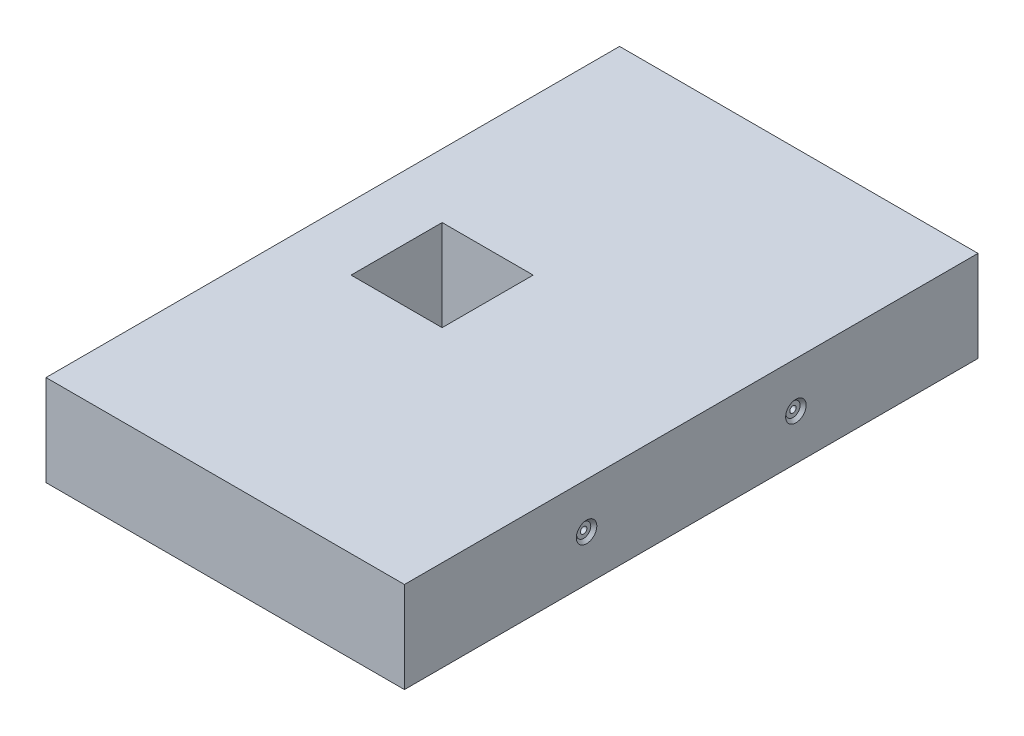
ISO-10303-21;
HEADER;
FILE_DESCRIPTION(('STEP AP214'),'2;1');
FILE_NAME('part.step','',(''),(''),'','','');
FILE_SCHEMA(('AUTOMOTIVE_DESIGN { 1 0 10303 214 1 1 1 1 }'));
ENDSEC;
DATA;
#1=APPLICATION_CONTEXT('core data for automotive mechanical design processes');
#2=APPLICATION_PROTOCOL_DEFINITION('international standard','automotive_design',2000,#1);
#3=PRODUCT_CONTEXT('',#1,'mechanical');
#4=PRODUCT('Part','Part','',(#3));
#5=PRODUCT_RELATED_PRODUCT_CATEGORY('part','',(#4));
#6=PRODUCT_DEFINITION_FORMATION('','',#4);
#7=PRODUCT_DEFINITION_CONTEXT('part definition',#1,'design');
#8=PRODUCT_DEFINITION('design','',#6,#7);
#9=PRODUCT_DEFINITION_SHAPE('','',#8);
#10=(LENGTH_UNIT() NAMED_UNIT(*) SI_UNIT(.MILLI.,.METRE.));
#11=(NAMED_UNIT(*) PLANE_ANGLE_UNIT() SI_UNIT($,.RADIAN.));
#12=(NAMED_UNIT(*) SI_UNIT($,.STERADIAN.) SOLID_ANGLE_UNIT());
#13=UNCERTAINTY_MEASURE_WITH_UNIT(LENGTH_MEASURE(1.E-05),#10,'distance_accuracy_value','');
#14=(GEOMETRIC_REPRESENTATION_CONTEXT(3) GLOBAL_UNCERTAINTY_ASSIGNED_CONTEXT((#13)) GLOBAL_UNIT_ASSIGNED_CONTEXT((#10,
#11,#12)) REPRESENTATION_CONTEXT('',''));
#15=CARTESIAN_POINT('',(0.,0.,0.));
#16=DIRECTION('',(0.,0.,1.));
#17=DIRECTION('',(1.,0.,0.));
#18=AXIS2_PLACEMENT_3D('',#15,#16,#17);
#19=CARTESIAN_POINT('',(0.,25.4,0.));
#20=DIRECTION('',(0.,1.,0.));
#21=DIRECTION('',(0.,0.,1.));
#22=AXIS2_PLACEMENT_3D('',#19,#20,#21);
#23=PLANE('',#22);
#24=DIRECTION('',(0.,0.,-1.));
#25=VECTOR('',#24,1.);
#26=CARTESIAN_POINT('',(50.,25.4,-80.));
#27=LINE('',#26,#25);
#28=CARTESIAN_POINT('',(50.,25.4,80.));
#29=VERTEX_POINT('',#28);
#30=CARTESIAN_POINT('',(50.,25.4,-80.));
#31=VERTEX_POINT('',#30);
#32=EDGE_CURVE('E162',#29,#31,#27,.T.);
#33=ORIENTED_EDGE('',*,*,#32,.T.);
#34=DIRECTION('',(-1.,0.,0.));
#35=VECTOR('',#34,1.);
#36=CARTESIAN_POINT('',(-50.,25.4,-80.));
#37=LINE('',#36,#35);
#38=CARTESIAN_POINT('',(-50.,25.4,-80.));
#39=VERTEX_POINT('',#38);
#40=EDGE_CURVE('E165',#31,#39,#37,.T.);
#41=ORIENTED_EDGE('',*,*,#40,.T.);
#42=DIRECTION('',(0.,0.,1.));
#43=VECTOR('',#42,1.);
#44=CARTESIAN_POINT('',(-50.,25.4,-80.));
#45=LINE('',#44,#43);
#46=CARTESIAN_POINT('',(-50.,25.4,80.));
#47=VERTEX_POINT('',#46);
#48=EDGE_CURVE('E168',#39,#47,#45,.T.);
#49=ORIENTED_EDGE('',*,*,#48,.T.);
#50=DIRECTION('',(1.,0.,0.));
#51=VECTOR('',#50,1.);
#52=CARTESIAN_POINT('',(-50.,25.4,80.));
#53=LINE('',#52,#51);
#54=EDGE_CURVE('E170',#47,#29,#53,.T.);
#55=ORIENTED_EDGE('',*,*,#54,.T.);
#56=EDGE_LOOP('',(#33,#41,#49,#55));
#57=FACE_BOUND('',#56,.T.);
#58=DIRECTION('',(-1.,0.,0.));
#59=VECTOR('',#58,1.);
#60=CARTESIAN_POINT('',(-32.19,25.4,-12.7));
#61=LINE('',#60,#59);
#62=CARTESIAN_POINT('',(-6.79,25.4,-12.7));
#63=VERTEX_POINT('',#62);
#64=CARTESIAN_POINT('',(-32.19,25.4,-12.7));
#65=VERTEX_POINT('',#64);
#66=EDGE_CURVE('E138',#63,#65,#61,.T.);
#67=ORIENTED_EDGE('',*,*,#66,.F.);
#68=DIRECTION('',(0.,0.,-1.));
#69=VECTOR('',#68,1.);
#70=CARTESIAN_POINT('',(-6.79,25.4,-12.7));
#71=LINE('',#70,#69);
#72=CARTESIAN_POINT('',(-6.79,25.4,12.7));
#73=VERTEX_POINT('',#72);
#74=EDGE_CURVE('E136',#73,#63,#71,.T.);
#75=ORIENTED_EDGE('',*,*,#74,.F.);
#76=DIRECTION('',(1.,0.,0.));
#77=VECTOR('',#76,1.);
#78=CARTESIAN_POINT('',(-32.19,25.4,12.7));
#79=LINE('',#78,#77);
#80=CARTESIAN_POINT('',(-32.19,25.4,12.7));
#81=VERTEX_POINT('',#80);
#82=EDGE_CURVE('E143',#81,#73,#79,.T.);
#83=ORIENTED_EDGE('',*,*,#82,.F.);
#84=DIRECTION('',(0.,0.,1.));
#85=VECTOR('',#84,1.);
#86=CARTESIAN_POINT('',(-32.19,25.4,-12.7));
#87=LINE('',#86,#85);
#88=EDGE_CURVE('E141',#65,#81,#87,.T.);
#89=ORIENTED_EDGE('',*,*,#88,.F.);
#90=EDGE_LOOP('',(#67,#75,#83,#89));
#91=FACE_BOUND('',#90,.T.);
#92=ADVANCED_FACE('F33',(#57,#91),#23,.T.);
#93=CARTESIAN_POINT('',(0.,0.,0.));
#94=DIRECTION('',(0.,1.,0.));
#95=DIRECTION('',(0.,0.,1.));
#96=AXIS2_PLACEMENT_3D('',#93,#94,#95);
#97=PLANE('',#96);
#98=DIRECTION('',(0.,0.,-1.));
#99=VECTOR('',#98,1.);
#100=CARTESIAN_POINT('',(50.,0.,-80.));
#101=LINE('',#100,#99);
#102=CARTESIAN_POINT('',(50.,0.,80.));
#103=VERTEX_POINT('',#102);
#104=CARTESIAN_POINT('',(50.,0.,-80.));
#105=VERTEX_POINT('',#104);
#106=EDGE_CURVE('E161',#103,#105,#101,.T.);
#107=ORIENTED_EDGE('',*,*,#106,.F.);
#108=DIRECTION('',(1.,0.,0.));
#109=VECTOR('',#108,1.);
#110=CARTESIAN_POINT('',(-50.,0.,80.));
#111=LINE('',#110,#109);
#112=CARTESIAN_POINT('',(-50.,0.,80.));
#113=VERTEX_POINT('',#112);
#114=EDGE_CURVE('E166',#113,#103,#111,.T.);
#115=ORIENTED_EDGE('',*,*,#114,.F.);
#116=DIRECTION('',(0.,0.,1.));
#117=VECTOR('',#116,1.);
#118=CARTESIAN_POINT('',(-50.,0.,-80.));
#119=LINE('',#118,#117);
#120=CARTESIAN_POINT('',(-50.,0.,-80.));
#121=VERTEX_POINT('',#120);
#122=EDGE_CURVE('E177',#121,#113,#119,.T.);
#123=ORIENTED_EDGE('',*,*,#122,.F.);
#124=DIRECTION('',(-1.,0.,0.));
#125=VECTOR('',#124,1.);
#126=CARTESIAN_POINT('',(-50.,0.,-80.));
#127=LINE('',#126,#125);
#128=EDGE_CURVE('E175',#105,#121,#127,.T.);
#129=ORIENTED_EDGE('',*,*,#128,.F.);
#130=EDGE_LOOP('',(#107,#115,#123,#129));
#131=FACE_BOUND('',#130,.T.);
#132=DIRECTION('',(0.,0.,-1.));
#133=VECTOR('',#132,1.);
#134=CARTESIAN_POINT('',(-6.79,0.,-12.7));
#135=LINE('',#134,#133);
#136=CARTESIAN_POINT('',(-6.79,0.,12.7));
#137=VERTEX_POINT('',#136);
#138=CARTESIAN_POINT('',(-6.79,0.,-12.7));
#139=VERTEX_POINT('',#138);
#140=EDGE_CURVE('E56',#137,#139,#135,.T.);
#141=ORIENTED_EDGE('',*,*,#140,.T.);
#142=DIRECTION('',(-1.,0.,0.));
#143=VECTOR('',#142,1.);
#144=CARTESIAN_POINT('',(-32.19,0.,-12.7));
#145=LINE('',#144,#143);
#146=CARTESIAN_POINT('',(-32.19,0.,-12.7));
#147=VERTEX_POINT('',#146);
#148=EDGE_CURVE('E147',#139,#147,#145,.T.);
#149=ORIENTED_EDGE('',*,*,#148,.T.);
#150=DIRECTION('',(0.,0.,1.));
#151=VECTOR('',#150,1.);
#152=CARTESIAN_POINT('',(-32.19,0.,-12.7));
#153=LINE('',#152,#151);
#154=CARTESIAN_POINT('',(-32.19,0.,12.7));
#155=VERTEX_POINT('',#154);
#156=EDGE_CURVE('E150',#147,#155,#153,.T.);
#157=ORIENTED_EDGE('',*,*,#156,.T.);
#158=DIRECTION('',(1.,0.,0.));
#159=VECTOR('',#158,1.);
#160=CARTESIAN_POINT('',(-32.19,0.,12.7));
#161=LINE('',#160,#159);
#162=EDGE_CURVE('E139',#155,#137,#161,.T.);
#163=ORIENTED_EDGE('',*,*,#162,.T.);
#164=EDGE_LOOP('',(#141,#149,#157,#163));
#165=FACE_BOUND('',#164,.T.);
#166=ADVANCED_FACE('F195',(#131,#165),#97,.F.);
#167=CARTESIAN_POINT('',(50.,25.4,-80.));
#168=DIRECTION('',(-1.,0.,0.));
#169=DIRECTION('',(0.,0.,1.));
#170=AXIS2_PLACEMENT_3D('',#167,#168,#169);
#171=PLANE('',#170);
#172=CARTESIAN_POINT('',(50.,12.7,29.2));
#173=DIRECTION('',(1.,0.,0.));
#174=DIRECTION('',(0.,0.,-1.));
#175=AXIS2_PLACEMENT_3D('',#172,#173,#174);
#176=CIRCLE('',#175,2.8575);
#177=CARTESIAN_POINT('',(50.,12.7,26.3425));
#178=VERTEX_POINT('',#177);
#179=EDGE_CURVE('E283',#178,#178,#176,.T.);
#180=ORIENTED_EDGE('',*,*,#179,.F.);
#181=EDGE_LOOP('',(#180));
#182=FACE_BOUND('',#181,.T.);
#183=CARTESIAN_POINT('',(50.,12.7,-29.2));
#184=DIRECTION('',(1.,0.,0.));
#185=DIRECTION('',(0.,0.,-1.));
#186=AXIS2_PLACEMENT_3D('',#183,#184,#185);
#187=CIRCLE('',#186,2.8575);
#188=CARTESIAN_POINT('',(50.,12.7,-32.0575));
#189=VERTEX_POINT('',#188);
#190=EDGE_CURVE('E114',#189,#189,#187,.T.);
#191=ORIENTED_EDGE('',*,*,#190,.F.);
#192=EDGE_LOOP('',(#191));
#193=FACE_BOUND('',#192,.T.);
#194=ORIENTED_EDGE('',*,*,#106,.T.);
#195=DIRECTION('',(0.,-1.,0.));
#196=VECTOR('',#195,1.);
#197=CARTESIAN_POINT('',(50.,25.4,-80.));
#198=LINE('',#197,#196);
#199=EDGE_CURVE('E11',#31,#105,#198,.T.);
#200=ORIENTED_EDGE('',*,*,#199,.F.);
#201=ORIENTED_EDGE('',*,*,#32,.F.);
#202=DIRECTION('',(0.,-1.,0.));
#203=VECTOR('',#202,1.);
#204=CARTESIAN_POINT('',(50.,25.4,80.));
#205=LINE('',#204,#203);
#206=EDGE_CURVE('E172',#29,#103,#205,.T.);
#207=ORIENTED_EDGE('',*,*,#206,.T.);
#208=EDGE_LOOP('',(#194,#200,#201,#207));
#209=FACE_BOUND('',#208,.T.);
#210=ADVANCED_FACE('F35',(#182,#193,#209),#171,.F.);
#211=CARTESIAN_POINT('',(-50.,25.4,-80.));
#212=DIRECTION('',(0.,0.,1.));
#213=DIRECTION('',(1.,0.,0.));
#214=AXIS2_PLACEMENT_3D('',#211,#212,#213);
#215=PLANE('',#214);
#216=ORIENTED_EDGE('',*,*,#128,.T.);
#217=DIRECTION('',(0.,-1.,0.));
#218=VECTOR('',#217,1.);
#219=CARTESIAN_POINT('',(-50.,25.4,-80.));
#220=LINE('',#219,#218);
#221=EDGE_CURVE('E41',#39,#121,#220,.T.);
#222=ORIENTED_EDGE('',*,*,#221,.F.);
#223=ORIENTED_EDGE('',*,*,#40,.F.);
#224=ORIENTED_EDGE('',*,*,#199,.T.);
#225=EDGE_LOOP('',(#216,#222,#223,#224));
#226=FACE_BOUND('',#225,.T.);
#227=ADVANCED_FACE('F206',(#226),#215,.F.);
#228=CARTESIAN_POINT('',(-50.,25.4,-80.));
#229=DIRECTION('',(1.,0.,0.));
#230=DIRECTION('',(0.,0.,-1.));
#231=AXIS2_PLACEMENT_3D('',#228,#229,#230);
#232=PLANE('',#231);
#233=ORIENTED_EDGE('',*,*,#122,.T.);
#234=DIRECTION('',(0.,-1.,0.));
#235=VECTOR('',#234,1.);
#236=CARTESIAN_POINT('',(-50.,25.4,80.));
#237=LINE('',#236,#235);
#238=EDGE_CURVE('E182',#47,#113,#237,.T.);
#239=ORIENTED_EDGE('',*,*,#238,.F.);
#240=ORIENTED_EDGE('',*,*,#48,.F.);
#241=ORIENTED_EDGE('',*,*,#221,.T.);
#242=EDGE_LOOP('',(#233,#239,#240,#241));
#243=FACE_BOUND('',#242,.T.);
#244=ADVANCED_FACE('F189',(#243),#232,.F.);
#245=CARTESIAN_POINT('',(-50.,25.4,80.));
#246=DIRECTION('',(0.,0.,-1.));
#247=DIRECTION('',(-1.,0.,0.));
#248=AXIS2_PLACEMENT_3D('',#245,#246,#247);
#249=PLANE('',#248);
#250=ORIENTED_EDGE('',*,*,#114,.T.);
#251=ORIENTED_EDGE('',*,*,#206,.F.);
#252=ORIENTED_EDGE('',*,*,#54,.F.);
#253=ORIENTED_EDGE('',*,*,#238,.T.);
#254=EDGE_LOOP('',(#250,#251,#252,#253));
#255=FACE_BOUND('',#254,.T.);
#256=ADVANCED_FACE('F199',(#255),#249,.F.);
#257=CARTESIAN_POINT('',(-6.79,25.4,-12.7));
#258=DIRECTION('',(-1.,0.,0.));
#259=DIRECTION('',(0.,0.,1.));
#260=AXIS2_PLACEMENT_3D('',#257,#258,#259);
#261=PLANE('',#260);
#262=ORIENTED_EDGE('',*,*,#140,.F.);
#263=DIRECTION('',(0.,-1.,0.));
#264=VECTOR('',#263,1.);
#265=CARTESIAN_POINT('',(-6.79,25.4,12.7));
#266=LINE('',#265,#264);
#267=EDGE_CURVE('E145',#73,#137,#266,.T.);
#268=ORIENTED_EDGE('',*,*,#267,.F.);
#269=ORIENTED_EDGE('',*,*,#74,.T.);
#270=DIRECTION('',(0.,-1.,0.));
#271=VECTOR('',#270,1.);
#272=CARTESIAN_POINT('',(-6.79,25.4,-12.7));
#273=LINE('',#272,#271);
#274=EDGE_CURVE('E159',#63,#139,#273,.T.);
#275=ORIENTED_EDGE('',*,*,#274,.T.);
#276=EDGE_LOOP('',(#262,#268,#269,#275));
#277=FACE_BOUND('',#276,.T.);
#278=ADVANCED_FACE('F221',(#277),#261,.T.);
#279=CARTESIAN_POINT('',(-32.19,25.4,-12.7));
#280=DIRECTION('',(0.,0.,1.));
#281=DIRECTION('',(1.,0.,0.));
#282=AXIS2_PLACEMENT_3D('',#279,#280,#281);
#283=PLANE('',#282);
#284=ORIENTED_EDGE('',*,*,#148,.F.);
#285=ORIENTED_EDGE('',*,*,#274,.F.);
#286=ORIENTED_EDGE('',*,*,#66,.T.);
#287=DIRECTION('',(0.,-1.,0.));
#288=VECTOR('',#287,1.);
#289=CARTESIAN_POINT('',(-32.19,25.4,-12.7));
#290=LINE('',#289,#288);
#291=EDGE_CURVE('E157',#65,#147,#290,.T.);
#292=ORIENTED_EDGE('',*,*,#291,.T.);
#293=EDGE_LOOP('',(#284,#285,#286,#292));
#294=FACE_BOUND('',#293,.T.);
#295=ADVANCED_FACE('F228',(#294),#283,.T.);
#296=CARTESIAN_POINT('',(-32.19,25.4,-12.7));
#297=DIRECTION('',(1.,0.,0.));
#298=DIRECTION('',(0.,0.,-1.));
#299=AXIS2_PLACEMENT_3D('',#296,#297,#298);
#300=PLANE('',#299);
#301=ORIENTED_EDGE('',*,*,#156,.F.);
#302=ORIENTED_EDGE('',*,*,#291,.F.);
#303=ORIENTED_EDGE('',*,*,#88,.T.);
#304=DIRECTION('',(0.,-1.,0.));
#305=VECTOR('',#304,1.);
#306=CARTESIAN_POINT('',(-32.19,25.4,12.7));
#307=LINE('',#306,#305);
#308=EDGE_CURVE('E48',#81,#155,#307,.T.);
#309=ORIENTED_EDGE('',*,*,#308,.T.);
#310=EDGE_LOOP('',(#301,#302,#303,#309));
#311=FACE_BOUND('',#310,.T.);
#312=ADVANCED_FACE('F232',(#311),#300,.T.);
#313=CARTESIAN_POINT('',(-32.19,25.4,12.7));
#314=DIRECTION('',(0.,0.,-1.));
#315=DIRECTION('',(-1.,0.,0.));
#316=AXIS2_PLACEMENT_3D('',#313,#314,#315);
#317=PLANE('',#316);
#318=ORIENTED_EDGE('',*,*,#162,.F.);
#319=ORIENTED_EDGE('',*,*,#308,.F.);
#320=ORIENTED_EDGE('',*,*,#82,.T.);
#321=ORIENTED_EDGE('',*,*,#267,.T.);
#322=EDGE_LOOP('',(#318,#319,#320,#321));
#323=FACE_BOUND('',#322,.T.);
#324=ADVANCED_FACE('F237',(#323),#317,.T.);
#325=CARTESIAN_POINT('',(20.,12.7,-29.2));
#326=DIRECTION('',(1.,0.,0.));
#327=DIRECTION('',(0.,0.,-1.));
#328=AXIS2_PLACEMENT_3D('',#325,#326,#327);
#329=CONICAL_SURFACE('',#328,0.888999999999992,1.02974425867665);
#330=CARTESIAN_POINT('',(19.4658349096845,12.7,-29.2));
#331=VERTEX_POINT('',#330);
#332=VERTEX_LOOP('',#331);
#333=FACE_BOUND('',#332,.T.);
#334=CARTESIAN_POINT('',(20.,12.7,-29.2));
#335=DIRECTION('',(1.,0.,0.));
#336=DIRECTION('',(0.,0.,-1.));
#337=AXIS2_PLACEMENT_3D('',#334,#335,#336);
#338=CIRCLE('',#337,0.888999999999992);
#339=CARTESIAN_POINT('',(20.,12.7,-30.089));
#340=VERTEX_POINT('',#339);
#341=EDGE_CURVE('E133',#340,#340,#338,.T.);
#342=ORIENTED_EDGE('',*,*,#341,.T.);
#343=EDGE_LOOP('',(#342));
#344=FACE_BOUND('',#343,.T.);
#345=ADVANCED_FACE('F243',(#333,#344),#329,.F.);
#346=CARTESIAN_POINT('',(50.,12.7,-29.2));
#347=DIRECTION('',(1.,0.,0.));
#348=DIRECTION('',(0.,0.,-1.));
#349=AXIS2_PLACEMENT_3D('',#346,#347,#348);
#350=CYLINDRICAL_SURFACE('',#349,0.888999999999994);
#351=ORIENTED_EDGE('',*,*,#341,.F.);
#352=EDGE_LOOP('',(#351));
#353=FACE_BOUND('',#352,.T.);
#354=CARTESIAN_POINT('',(49.1872,12.7,-29.2));
#355=DIRECTION('',(1.,0.,0.));
#356=DIRECTION('',(0.,0.,-1.));
#357=AXIS2_PLACEMENT_3D('',#354,#355,#356);
#358=CIRCLE('',#357,0.888999999999996);
#359=CARTESIAN_POINT('',(49.1872,12.7,-30.089));
#360=VERTEX_POINT('',#359);
#361=EDGE_CURVE('E130',#360,#360,#358,.T.);
#362=ORIENTED_EDGE('',*,*,#361,.T.);
#363=EDGE_LOOP('',(#362));
#364=FACE_BOUND('',#363,.T.);
#365=ADVANCED_FACE('F246',(#353,#364),#350,.F.);
#366=CARTESIAN_POINT('',(49.1872,13.589,-29.2));
#367=DIRECTION('',(-1.,0.,0.));
#368=DIRECTION('',(0.,0.,1.));
#369=AXIS2_PLACEMENT_3D('',#366,#367,#368);
#370=PLANE('',#369);
#371=ORIENTED_EDGE('',*,*,#361,.F.);
#372=EDGE_LOOP('',(#371));
#373=FACE_BOUND('',#372,.T.);
#374=CARTESIAN_POINT('',(49.1872,12.7,-29.2));
#375=DIRECTION('',(1.,0.,0.));
#376=DIRECTION('',(0.,0.,-1.));
#377=AXIS2_PLACEMENT_3D('',#374,#375,#376);
#378=CIRCLE('',#377,1.98501);
#379=CARTESIAN_POINT('',(49.1872,12.7,-31.18501));
#380=VERTEX_POINT('',#379);
#381=EDGE_CURVE('E127',#380,#380,#378,.T.);
#382=ORIENTED_EDGE('',*,*,#381,.T.);
#383=EDGE_LOOP('',(#382));
#384=FACE_BOUND('',#383,.T.);
#385=ADVANCED_FACE('F250',(#373,#384),#370,.F.);
#386=CARTESIAN_POINT('',(50.,12.7,-29.2));
#387=DIRECTION('',(1.,0.,0.));
#388=DIRECTION('',(0.,0.,-1.));
#389=AXIS2_PLACEMENT_3D('',#386,#387,#388);
#390=CYLINDRICAL_SURFACE('',#389,1.98501);
#391=ORIENTED_EDGE('',*,*,#381,.F.);
#392=EDGE_LOOP('',(#391));
#393=FACE_BOUND('',#392,.T.);
#394=CARTESIAN_POINT('',(49.12751,12.7,-29.2));
#395=DIRECTION('',(1.,0.,0.));
#396=DIRECTION('',(0.,0.,-1.));
#397=AXIS2_PLACEMENT_3D('',#394,#395,#396);
#398=CIRCLE('',#397,1.98501);
#399=CARTESIAN_POINT('',(49.12751,12.7,-31.18501));
#400=VERTEX_POINT('',#399);
#401=EDGE_CURVE('E118',#400,#400,#398,.T.);
#402=ORIENTED_EDGE('',*,*,#401,.T.);
#403=EDGE_LOOP('',(#402));
#404=FACE_BOUND('',#403,.T.);
#405=ADVANCED_FACE('F254',(#393,#404),#390,.T.);
#406=CARTESIAN_POINT('',(50.,12.7,-29.2));
#407=DIRECTION('',(1.,0.,0.));
#408=DIRECTION('',(0.,0.,-1.));
#409=AXIS2_PLACEMENT_3D('',#406,#407,#408);
#410=CONICAL_SURFACE('',#409,2.8575,0.785398163397449);
#411=ORIENTED_EDGE('',*,*,#401,.F.);
#412=EDGE_LOOP('',(#411));
#413=FACE_BOUND('',#412,.T.);
#414=ORIENTED_EDGE('',*,*,#190,.T.);
#415=EDGE_LOOP('',(#414));
#416=FACE_BOUND('',#415,.T.);
#417=ADVANCED_FACE('F108',(#413,#416),#410,.F.);
#418=CARTESIAN_POINT('',(20.,12.7,29.2));
#419=DIRECTION('',(1.,0.,0.));
#420=DIRECTION('',(0.,0.,-1.));
#421=AXIS2_PLACEMENT_3D('',#418,#419,#420);
#422=CONICAL_SURFACE('',#421,0.888999999999992,1.02974425867665);
#423=CARTESIAN_POINT('',(19.4658349096845,12.7,29.2));
#424=VERTEX_POINT('',#423);
#425=VERTEX_LOOP('',#424);
#426=FACE_BOUND('',#425,.T.);
#427=CARTESIAN_POINT('',(20.,12.7,29.2));
#428=DIRECTION('',(1.,0.,0.));
#429=DIRECTION('',(0.,0.,-1.));
#430=AXIS2_PLACEMENT_3D('',#427,#428,#429);
#431=CIRCLE('',#430,0.888999999999992);
#432=CARTESIAN_POINT('',(20.,12.7,28.311));
#433=VERTEX_POINT('',#432);
#434=EDGE_CURVE('E112',#433,#433,#431,.T.);
#435=ORIENTED_EDGE('',*,*,#434,.T.);
#436=EDGE_LOOP('',(#435));
#437=FACE_BOUND('',#436,.T.);
#438=ADVANCED_FACE('F104',(#426,#437),#422,.F.);
#439=CARTESIAN_POINT('',(50.,12.7,29.2));
#440=DIRECTION('',(1.,0.,0.));
#441=DIRECTION('',(0.,0.,-1.));
#442=AXIS2_PLACEMENT_3D('',#439,#440,#441);
#443=CYLINDRICAL_SURFACE('',#442,0.888999999999994);
#444=ORIENTED_EDGE('',*,*,#434,.F.);
#445=EDGE_LOOP('',(#444));
#446=FACE_BOUND('',#445,.T.);
#447=CARTESIAN_POINT('',(49.1872,12.7,29.2));
#448=DIRECTION('',(1.,0.,0.));
#449=DIRECTION('',(0.,0.,-1.));
#450=AXIS2_PLACEMENT_3D('',#447,#448,#449);
#451=CIRCLE('',#450,0.888999999999996);
#452=CARTESIAN_POINT('',(49.1872,12.7,28.311));
#453=VERTEX_POINT('',#452);
#454=EDGE_CURVE('E115',#453,#453,#451,.T.);
#455=ORIENTED_EDGE('',*,*,#454,.T.);
#456=EDGE_LOOP('',(#455));
#457=FACE_BOUND('',#456,.T.);
#458=ADVANCED_FACE('F107',(#446,#457),#443,.F.);
#459=CARTESIAN_POINT('',(49.1872,13.589,29.2));
#460=DIRECTION('',(-1.,0.,0.));
#461=DIRECTION('',(0.,0.,1.));
#462=AXIS2_PLACEMENT_3D('',#459,#460,#461);
#463=PLANE('',#462);
#464=ORIENTED_EDGE('',*,*,#454,.F.);
#465=EDGE_LOOP('',(#464));
#466=FACE_BOUND('',#465,.T.);
#467=CARTESIAN_POINT('',(49.1872,12.7,29.2));
#468=DIRECTION('',(1.,0.,0.));
#469=DIRECTION('',(0.,0.,-1.));
#470=AXIS2_PLACEMENT_3D('',#467,#468,#469);
#471=CIRCLE('',#470,1.98501);
#472=CARTESIAN_POINT('',(49.1872,12.7,27.21499));
#473=VERTEX_POINT('',#472);
#474=EDGE_CURVE('E121',#473,#473,#471,.T.);
#475=ORIENTED_EDGE('',*,*,#474,.T.);
#476=EDGE_LOOP('',(#475));
#477=FACE_BOUND('',#476,.T.);
#478=ADVANCED_FACE('F264',(#466,#477),#463,.F.);
#479=CARTESIAN_POINT('',(50.,12.7,29.2));
#480=DIRECTION('',(1.,0.,0.));
#481=DIRECTION('',(0.,0.,-1.));
#482=AXIS2_PLACEMENT_3D('',#479,#480,#481);
#483=CYLINDRICAL_SURFACE('',#482,1.98501);
#484=ORIENTED_EDGE('',*,*,#474,.F.);
#485=EDGE_LOOP('',(#484));
#486=FACE_BOUND('',#485,.T.);
#487=CARTESIAN_POINT('',(49.12751,12.7,29.2));
#488=DIRECTION('',(1.,0.,0.));
#489=DIRECTION('',(0.,0.,-1.));
#490=AXIS2_PLACEMENT_3D('',#487,#488,#489);
#491=CIRCLE('',#490,1.98501);
#492=CARTESIAN_POINT('',(49.12751,12.7,27.21499));
#493=VERTEX_POINT('',#492);
#494=EDGE_CURVE('E280',#493,#493,#491,.T.);
#495=ORIENTED_EDGE('',*,*,#494,.T.);
#496=EDGE_LOOP('',(#495));
#497=FACE_BOUND('',#496,.T.);
#498=ADVANCED_FACE('F267',(#486,#497),#483,.T.);
#499=CARTESIAN_POINT('',(50.,12.7,29.2));
#500=DIRECTION('',(1.,0.,0.));
#501=DIRECTION('',(0.,0.,-1.));
#502=AXIS2_PLACEMENT_3D('',#499,#500,#501);
#503=CONICAL_SURFACE('',#502,2.8575,0.785398163397449);
#504=ORIENTED_EDGE('',*,*,#494,.F.);
#505=EDGE_LOOP('',(#504));
#506=FACE_BOUND('',#505,.T.);
#507=ORIENTED_EDGE('',*,*,#179,.T.);
#508=EDGE_LOOP('',(#507));
#509=FACE_BOUND('',#508,.T.);
#510=ADVANCED_FACE('F271',(#506,#509),#503,.F.);
#511=CLOSED_SHELL('',(#92,#166,#210,#227,#244,#256,#278,#295,#312,#324,#345,#365,#385,#405,#417,
#438,#458,#478,#498,#510));
#512=MANIFOLD_SOLID_BREP('B2',#511);
#513=ADVANCED_BREP_SHAPE_REPRESENTATION('',(#18,#512),#14);
#514=SHAPE_DEFINITION_REPRESENTATION(#9,#513);
ENDSEC;
END-ISO-10303-21;
